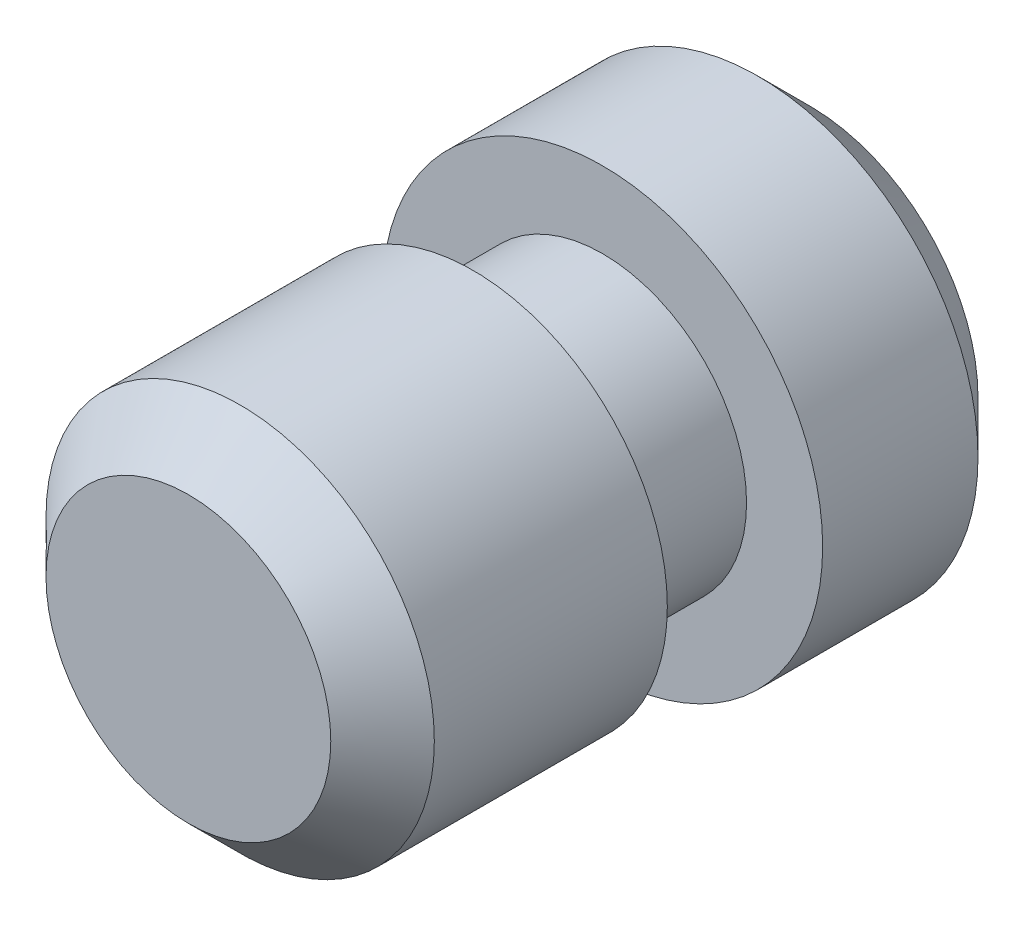
ISO-10303-21;
HEADER;
FILE_DESCRIPTION(('STEP AP214'),'2;1');
FILE_NAME('part.step','',(''),(''),'','','');
FILE_SCHEMA(('AUTOMOTIVE_DESIGN { 1 0 10303 214 1 1 1 1 }'));
ENDSEC;
DATA;
#1=APPLICATION_CONTEXT('core data for automotive mechanical design processes');
#2=APPLICATION_PROTOCOL_DEFINITION('international standard','automotive_design',2000,#1);
#3=PRODUCT_CONTEXT('',#1,'mechanical');
#4=PRODUCT('Part','Part','',(#3));
#5=PRODUCT_RELATED_PRODUCT_CATEGORY('part','',(#4));
#6=PRODUCT_DEFINITION_FORMATION('','',#4);
#7=PRODUCT_DEFINITION_CONTEXT('part definition',#1,'design');
#8=PRODUCT_DEFINITION('design','',#6,#7);
#9=PRODUCT_DEFINITION_SHAPE('','',#8);
#10=(LENGTH_UNIT() NAMED_UNIT(*) SI_UNIT(.MILLI.,.METRE.));
#11=(NAMED_UNIT(*) PLANE_ANGLE_UNIT() SI_UNIT($,.RADIAN.));
#12=(NAMED_UNIT(*) SI_UNIT($,.STERADIAN.) SOLID_ANGLE_UNIT());
#13=UNCERTAINTY_MEASURE_WITH_UNIT(LENGTH_MEASURE(1.E-05),#10,'distance_accuracy_value','');
#14=(GEOMETRIC_REPRESENTATION_CONTEXT(3) GLOBAL_UNCERTAINTY_ASSIGNED_CONTEXT((#13)) GLOBAL_UNIT_ASSIGNED_CONTEXT((#10,
#11,#12)) REPRESENTATION_CONTEXT('',''));
#15=CARTESIAN_POINT('',(0.,0.,0.));
#16=DIRECTION('',(0.,0.,1.));
#17=DIRECTION('',(1.,0.,0.));
#18=AXIS2_PLACEMENT_3D('',#15,#16,#17);
#19=CARTESIAN_POINT('',(0.,0.,5.07999999999997));
#20=DIRECTION('',(0.,0.,-1.));
#21=DIRECTION('',(-1.,0.,0.));
#22=AXIS2_PLACEMENT_3D('',#19,#20,#21);
#23=CYLINDRICAL_SURFACE('',#22,5.3975);
#24=CARTESIAN_POINT('',(0.,0.,1.26999999999999));
#25=DIRECTION('',(0.,0.,1.));
#26=DIRECTION('',(1.,0.,0.));
#27=AXIS2_PLACEMENT_3D('',#24,#25,#26);
#28=CIRCLE('',#27,5.3975);
#29=CARTESIAN_POINT('',(5.3975,0.,1.26999999999999));
#30=VERTEX_POINT('',#29);
#31=EDGE_CURVE('E43',#30,#30,#28,.T.);
#32=ORIENTED_EDGE('',*,*,#31,.T.);
#33=EDGE_LOOP('',(#32));
#34=FACE_BOUND('',#33,.T.);
#35=CARTESIAN_POINT('',(0.,0.,5.07999999999997));
#36=DIRECTION('',(0.,0.,1.));
#37=DIRECTION('',(1.,0.,0.));
#38=AXIS2_PLACEMENT_3D('',#35,#36,#37);
#39=CIRCLE('',#38,5.3975);
#40=CARTESIAN_POINT('',(5.3975,0.,5.07999999999997));
#41=VERTEX_POINT('',#40);
#42=EDGE_CURVE('E57',#41,#41,#39,.T.);
#43=ORIENTED_EDGE('',*,*,#42,.F.);
#44=EDGE_LOOP('',(#43));
#45=FACE_BOUND('',#44,.T.);
#46=ADVANCED_FACE('F36',(#34,#45),#23,.T.);
#47=CARTESIAN_POINT('',(0.,0.,5.07999999999997));
#48=DIRECTION('',(0.,0.,1.));
#49=DIRECTION('',(1.,0.,0.));
#50=AXIS2_PLACEMENT_3D('',#47,#48,#49);
#51=PLANE('',#50);
#52=CARTESIAN_POINT('',(0.,0.,5.07999999999997));
#53=DIRECTION('',(0.,0.,1.));
#54=DIRECTION('',(1.,0.,0.));
#55=AXIS2_PLACEMENT_3D('',#52,#53,#54);
#56=CIRCLE('',#55,3.5306);
#57=CARTESIAN_POINT('',(3.5306,0.,5.07999999999997));
#58=VERTEX_POINT('',#57);
#59=EDGE_CURVE('E56',#58,#58,#56,.T.);
#60=ORIENTED_EDGE('',*,*,#59,.F.);
#61=EDGE_LOOP('',(#60));
#62=FACE_BOUND('',#61,.T.);
#63=ORIENTED_EDGE('',*,*,#42,.T.);
#64=EDGE_LOOP('',(#63));
#65=FACE_BOUND('',#64,.T.);
#66=ADVANCED_FACE('F86',(#62,#65),#51,.T.);
#67=CARTESIAN_POINT('',(0.,0.,0.));
#68=DIRECTION('',(0.,0.,1.));
#69=DIRECTION('',(1.,0.,0.));
#70=AXIS2_PLACEMENT_3D('',#67,#68,#69);
#71=PLANE('',#70);
#72=CARTESIAN_POINT('',(0.,0.,0.));
#73=DIRECTION('',(0.,0.,1.));
#74=DIRECTION('',(1.,0.,0.));
#75=AXIS2_PLACEMENT_3D('',#72,#73,#74);
#76=CIRCLE('',#75,4.1275);
#77=CARTESIAN_POINT('',(4.1275,0.,0.));
#78=VERTEX_POINT('',#77);
#79=EDGE_CURVE('E10',#78,#78,#76,.F.);
#80=ORIENTED_EDGE('',*,*,#79,.T.);
#81=EDGE_LOOP('',(#80));
#82=FACE_BOUND('',#81,.T.);
#83=ADVANCED_FACE('F91',(#82),#71,.F.);
#84=CARTESIAN_POINT('',(0.,0.,8.25500000000001));
#85=DIRECTION('',(0.,0.,-1.));
#86=DIRECTION('',(-1.,0.,0.));
#87=AXIS2_PLACEMENT_3D('',#84,#85,#86);
#88=CYLINDRICAL_SURFACE('',#87,3.5306);
#89=CARTESIAN_POINT('',(0.,0.,8.25500000000001));
#90=DIRECTION('',(0.,0.,1.));
#91=DIRECTION('',(1.,0.,0.));
#92=AXIS2_PLACEMENT_3D('',#89,#90,#91);
#93=CIRCLE('',#92,3.5306);
#94=CARTESIAN_POINT('',(3.5306,0.,8.25500000000001));
#95=VERTEX_POINT('',#94);
#96=EDGE_CURVE('E60',#95,#95,#93,.T.);
#97=ORIENTED_EDGE('',*,*,#96,.F.);
#98=EDGE_LOOP('',(#97));
#99=FACE_BOUND('',#98,.T.);
#100=ORIENTED_EDGE('',*,*,#59,.T.);
#101=EDGE_LOOP('',(#100));
#102=FACE_BOUND('',#101,.T.);
#103=ADVANCED_FACE('F97',(#99,#102),#88,.T.);
#104=CARTESIAN_POINT('',(0.,0.,15.24));
#105=DIRECTION('',(0.,0.,-1.));
#106=DIRECTION('',(-1.,0.,0.));
#107=AXIS2_PLACEMENT_3D('',#104,#105,#106);
#108=CYLINDRICAL_SURFACE('',#107,4.7625);
#109=CARTESIAN_POINT('',(0.,0.,13.97));
#110=DIRECTION('',(0.,0.,1.));
#111=DIRECTION('',(1.,0.,0.));
#112=AXIS2_PLACEMENT_3D('',#109,#110,#111);
#113=CIRCLE('',#112,4.7625);
#114=CARTESIAN_POINT('',(4.7625,0.,13.97));
#115=VERTEX_POINT('',#114);
#116=EDGE_CURVE('E47',#115,#115,#113,.F.);
#117=ORIENTED_EDGE('',*,*,#116,.T.);
#118=EDGE_LOOP('',(#117));
#119=FACE_BOUND('',#118,.T.);
#120=CARTESIAN_POINT('',(0.,0.,8.25500000000001));
#121=DIRECTION('',(0.,0.,1.));
#122=DIRECTION('',(1.,0.,0.));
#123=AXIS2_PLACEMENT_3D('',#120,#121,#122);
#124=CIRCLE('',#123,4.7625);
#125=CARTESIAN_POINT('',(4.7625,0.,8.25500000000001));
#126=VERTEX_POINT('',#125);
#127=EDGE_CURVE('E65',#126,#126,#124,.T.);
#128=ORIENTED_EDGE('',*,*,#127,.T.);
#129=EDGE_LOOP('',(#128));
#130=FACE_BOUND('',#129,.T.);
#131=ADVANCED_FACE('F69',(#119,#130),#108,.T.);
#132=CARTESIAN_POINT('',(0.,0.,15.24));
#133=DIRECTION('',(0.,0.,1.));
#134=DIRECTION('',(1.,0.,0.));
#135=AXIS2_PLACEMENT_3D('',#132,#133,#134);
#136=PLANE('',#135);
#137=CARTESIAN_POINT('',(0.,0.,15.24));
#138=DIRECTION('',(0.,0.,1.));
#139=DIRECTION('',(1.,0.,0.));
#140=AXIS2_PLACEMENT_3D('',#137,#138,#139);
#141=CIRCLE('',#140,3.49250000000001);
#142=CARTESIAN_POINT('',(3.49250000000001,0.,15.24));
#143=VERTEX_POINT('',#142);
#144=EDGE_CURVE('E51',#143,#143,#141,.T.);
#145=ORIENTED_EDGE('',*,*,#144,.T.);
#146=EDGE_LOOP('',(#145));
#147=FACE_BOUND('',#146,.T.);
#148=ADVANCED_FACE('F74',(#147),#136,.T.);
#149=CARTESIAN_POINT('',(0.,0.,8.25500000000001));
#150=DIRECTION('',(0.,0.,1.));
#151=DIRECTION('',(1.,0.,0.));
#152=AXIS2_PLACEMENT_3D('',#149,#150,#151);
#153=PLANE('',#152);
#154=ORIENTED_EDGE('',*,*,#96,.T.);
#155=EDGE_LOOP('',(#154));
#156=FACE_BOUND('',#155,.T.);
#157=ORIENTED_EDGE('',*,*,#127,.F.);
#158=EDGE_LOOP('',(#157));
#159=FACE_BOUND('',#158,.T.);
#160=ADVANCED_FACE('F71',(#156,#159),#153,.F.);
#161=CARTESIAN_POINT('',(0.,0.,15.24));
#162=DIRECTION('',(0.,0.,-1.));
#163=DIRECTION('',(-1.,0.,0.));
#164=AXIS2_PLACEMENT_3D('',#161,#162,#163);
#165=CONICAL_SURFACE('',#164,3.49250000000001,0.785398163397448);
#166=ORIENTED_EDGE('',*,*,#116,.F.);
#167=EDGE_LOOP('',(#166));
#168=FACE_BOUND('',#167,.T.);
#169=ORIENTED_EDGE('',*,*,#144,.F.);
#170=EDGE_LOOP('',(#169));
#171=FACE_BOUND('',#170,.T.);
#172=ADVANCED_FACE('F73',(#168,#171),#165,.T.);
#173=CARTESIAN_POINT('',(0.,0.,1.26999999999999));
#174=DIRECTION('',(0.,0.,1.));
#175=DIRECTION('',(1.,0.,0.));
#176=AXIS2_PLACEMENT_3D('',#173,#174,#175);
#177=CONICAL_SURFACE('',#176,5.3975,0.785398163397449);
#178=ORIENTED_EDGE('',*,*,#79,.F.);
#179=EDGE_LOOP('',(#178));
#180=FACE_BOUND('',#179,.T.);
#181=ORIENTED_EDGE('',*,*,#31,.F.);
#182=EDGE_LOOP('',(#181));
#183=FACE_BOUND('',#182,.T.);
#184=ADVANCED_FACE('F38',(#180,#183),#177,.T.);
#185=CLOSED_SHELL('',(#46,#66,#83,#103,#131,#148,#160,#172,#184));
#186=MANIFOLD_SOLID_BREP('B2',#185);
#187=ADVANCED_BREP_SHAPE_REPRESENTATION('',(#18,#186),#14);
#188=SHAPE_DEFINITION_REPRESENTATION(#9,#187);
ENDSEC;
END-ISO-10303-21;
